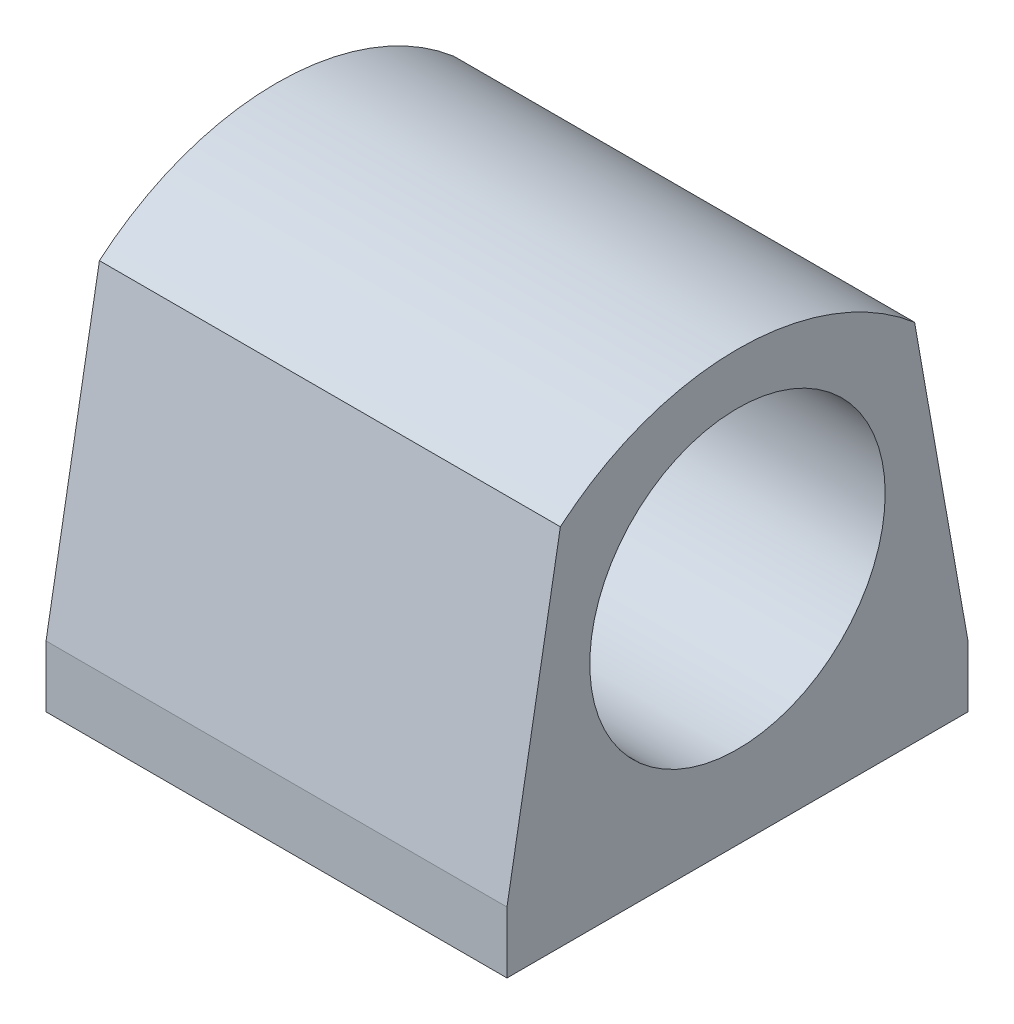
ISO-10303-21;
HEADER;
FILE_DESCRIPTION(('STEP AP214'),'2;1');
FILE_NAME('part.step','',(''),(''),'','','');
FILE_SCHEMA(('AUTOMOTIVE_DESIGN { 1 0 10303 214 1 1 1 1 }'));
ENDSEC;
DATA;
#1=APPLICATION_CONTEXT('core data for automotive mechanical design processes');
#2=APPLICATION_PROTOCOL_DEFINITION('international standard','automotive_design',2000,#1);
#3=PRODUCT_CONTEXT('',#1,'mechanical');
#4=PRODUCT('Part','Part','',(#3));
#5=PRODUCT_RELATED_PRODUCT_CATEGORY('part','',(#4));
#6=PRODUCT_DEFINITION_FORMATION('','',#4);
#7=PRODUCT_DEFINITION_CONTEXT('part definition',#1,'design');
#8=PRODUCT_DEFINITION('design','',#6,#7);
#9=PRODUCT_DEFINITION_SHAPE('','',#8);
#10=(LENGTH_UNIT() NAMED_UNIT(*) SI_UNIT(.MILLI.,.METRE.));
#11=(NAMED_UNIT(*) PLANE_ANGLE_UNIT() SI_UNIT($,.RADIAN.));
#12=(NAMED_UNIT(*) SI_UNIT($,.STERADIAN.) SOLID_ANGLE_UNIT());
#13=UNCERTAINTY_MEASURE_WITH_UNIT(LENGTH_MEASURE(1.E-05),#10,'distance_accuracy_value','');
#14=(GEOMETRIC_REPRESENTATION_CONTEXT(3) GLOBAL_UNCERTAINTY_ASSIGNED_CONTEXT((#13)) GLOBAL_UNIT_ASSIGNED_CONTEXT((#10,
#11,#12)) REPRESENTATION_CONTEXT('',''));
#15=CARTESIAN_POINT('',(0.,0.,0.));
#16=DIRECTION('',(0.,0.,1.));
#17=DIRECTION('',(1.,0.,0.));
#18=AXIS2_PLACEMENT_3D('',#15,#16,#17);
#19=CARTESIAN_POINT('',(0.,0.,0.));
#20=DIRECTION('',(0.,-1.,0.));
#21=DIRECTION('',(0.,0.,-1.));
#22=AXIS2_PLACEMENT_3D('',#19,#20,#21);
#23=PLANE('',#22);
#24=DIRECTION('',(0.,0.,1.));
#25=VECTOR('',#24,1.);
#26=CARTESIAN_POINT('',(-19.05,0.,19.05));
#27=LINE('',#26,#25);
#28=CARTESIAN_POINT('',(-19.05,0.,-13.97));
#29=VERTEX_POINT('',#28);
#30=CARTESIAN_POINT('',(-19.05,0.,19.05));
#31=VERTEX_POINT('',#30);
#32=EDGE_CURVE('E139',#29,#31,#27,.T.);
#33=ORIENTED_EDGE('',*,*,#32,.F.);
#34=DIRECTION('',(1.,0.,0.));
#35=VECTOR('',#34,1.);
#36=CARTESIAN_POINT('',(0.,0.,-13.97));
#37=LINE('',#36,#35);
#38=CARTESIAN_POINT('',(0.,0.,-13.97));
#39=VERTEX_POINT('',#38);
#40=EDGE_CURVE('E135',#29,#39,#37,.T.);
#41=ORIENTED_EDGE('',*,*,#40,.T.);
#42=DIRECTION('',(0.,0.,-1.));
#43=VECTOR('',#42,1.);
#44=CARTESIAN_POINT('',(0.,0.,-13.97));
#45=LINE('',#44,#43);
#46=CARTESIAN_POINT('',(0.,0.,-19.05));
#47=VERTEX_POINT('',#46);
#48=EDGE_CURVE('E122',#39,#47,#45,.T.);
#49=ORIENTED_EDGE('',*,*,#48,.T.);
#50=DIRECTION('',(-1.,0.,0.));
#51=VECTOR('',#50,1.);
#52=CARTESIAN_POINT('',(-19.05,0.,-19.05));
#53=LINE('',#52,#51);
#54=CARTESIAN_POINT('',(19.05,0.,-19.05));
#55=VERTEX_POINT('',#54);
#56=EDGE_CURVE('E181',#55,#47,#53,.T.);
#57=ORIENTED_EDGE('',*,*,#56,.F.);
#58=DIRECTION('',(0.,0.,-1.));
#59=VECTOR('',#58,1.);
#60=CARTESIAN_POINT('',(19.05,0.,19.05));
#61=LINE('',#60,#59);
#62=CARTESIAN_POINT('',(19.05,0.,19.05));
#63=VERTEX_POINT('',#62);
#64=EDGE_CURVE('E172',#63,#55,#61,.T.);
#65=ORIENTED_EDGE('',*,*,#64,.F.);
#66=DIRECTION('',(1.,0.,0.));
#67=VECTOR('',#66,1.);
#68=CARTESIAN_POINT('',(-19.05,0.,19.05));
#69=LINE('',#68,#67);
#70=EDGE_CURVE('E90',#31,#63,#69,.T.);
#71=ORIENTED_EDGE('',*,*,#70,.F.);
#72=EDGE_LOOP('',(#33,#41,#49,#57,#65,#71));
#73=FACE_BOUND('',#72,.T.);
#74=ADVANCED_FACE('F49',(#73),#23,.T.);
#75=CARTESIAN_POINT('',(19.05,5.08,19.05));
#76=DIRECTION('',(-1.,0.,0.));
#77=DIRECTION('',(0.,0.,1.));
#78=AXIS2_PLACEMENT_3D('',#75,#76,#77);
#79=PLANE('',#78);
#80=CARTESIAN_POINT('',(19.05,19.05,0.));
#81=DIRECTION('',(1.,0.,0.));
#82=DIRECTION('',(0.,0.,-1.));
#83=AXIS2_PLACEMENT_3D('',#80,#81,#82);
#84=CIRCLE('',#83,12.2084592);
#85=CARTESIAN_POINT('',(19.05,19.05,-12.2084592));
#86=VERTEX_POINT('',#85);
#87=EDGE_CURVE('E144',#86,#86,#84,.T.);
#88=ORIENTED_EDGE('',*,*,#87,.F.);
#89=EDGE_LOOP('',(#88));
#90=FACE_BOUND('',#89,.T.);
#91=ORIENTED_EDGE('',*,*,#64,.T.);
#92=DIRECTION('',(0.,-1.,0.));
#93=VECTOR('',#92,1.);
#94=CARTESIAN_POINT('',(19.05,5.08,-19.05));
#95=LINE('',#94,#93);
#96=CARTESIAN_POINT('',(19.05,5.08,-19.05));
#97=VERTEX_POINT('',#96);
#98=EDGE_CURVE('E13',#97,#55,#95,.T.);
#99=ORIENTED_EDGE('',*,*,#98,.F.);
#100=DIRECTION('',(0.,0.984807753012207,0.173648177666935));
#101=VECTOR('',#100,1.);
#102=CARTESIAN_POINT('',(19.05,5.08,-19.05));
#103=LINE('',#102,#101);
#104=CARTESIAN_POINT('',(19.05,30.0941169265101,-14.6393362872599));
#105=VERTEX_POINT('',#104);
#106=EDGE_CURVE('E149',#97,#105,#103,.T.);
#107=ORIENTED_EDGE('',*,*,#106,.T.);
#108=CARTESIAN_POINT('',(19.05,12.9099699901589,1.11022302462516E-13));
#109=DIRECTION('',(1.,0.,0.));
#110=DIRECTION('',(0.,0.,1.));
#111=AXIS2_PLACEMENT_3D('',#108,#109,#110);
#112=CIRCLE('',#111,22.5744340540708);
#113=CARTESIAN_POINT('',(19.05,30.0941169265101,14.6393362872601));
#114=VERTEX_POINT('',#113);
#115=EDGE_CURVE('E165',#105,#114,#112,.T.);
#116=ORIENTED_EDGE('',*,*,#115,.T.);
#117=DIRECTION('',(0.,-0.984807753012209,0.173648177666927));
#118=VECTOR('',#117,1.);
#119=CARTESIAN_POINT('',(19.05,5.08,19.05));
#120=LINE('',#119,#118);
#121=CARTESIAN_POINT('',(19.05,5.08,19.05));
#122=VERTEX_POINT('',#121);
#123=EDGE_CURVE('E156',#114,#122,#120,.T.);
#124=ORIENTED_EDGE('',*,*,#123,.T.);
#125=DIRECTION('',(0.,-1.,0.));
#126=VECTOR('',#125,1.);
#127=CARTESIAN_POINT('',(19.05,5.08,19.05));
#128=LINE('',#127,#126);
#129=EDGE_CURVE('E178',#122,#63,#128,.T.);
#130=ORIENTED_EDGE('',*,*,#129,.T.);
#131=EDGE_LOOP('',(#91,#99,#107,#116,#124,#130));
#132=FACE_BOUND('',#131,.T.);
#133=ADVANCED_FACE('F51',(#90,#132),#79,.F.);
#134=CARTESIAN_POINT('',(-19.05,5.08,-19.05));
#135=DIRECTION('',(0.,0.,1.));
#136=DIRECTION('',(1.,0.,0.));
#137=AXIS2_PLACEMENT_3D('',#134,#135,#136);
#138=PLANE('',#137);
#139=ORIENTED_EDGE('',*,*,#56,.T.);
#140=DIRECTION('',(-0.707106781186548,-0.707106781186547,0.));
#141=VECTOR('',#140,1.);
#142=CARTESIAN_POINT('',(-19.05,-19.05,-19.05));
#143=LINE('',#142,#141);
#144=CARTESIAN_POINT('',(-19.05,-19.05,-19.05));
#145=VERTEX_POINT('',#144);
#146=EDGE_CURVE('E64',#47,#145,#143,.T.);
#147=ORIENTED_EDGE('',*,*,#146,.T.);
#148=DIRECTION('',(0.,-1.,0.));
#149=VECTOR('',#148,1.);
#150=CARTESIAN_POINT('',(-19.05,5.08,-19.05));
#151=LINE('',#150,#149);
#152=CARTESIAN_POINT('',(-19.05,5.08,-19.05));
#153=VERTEX_POINT('',#152);
#154=EDGE_CURVE('E57',#153,#145,#151,.T.);
#155=ORIENTED_EDGE('',*,*,#154,.F.);
#156=DIRECTION('',(-1.,0.,0.));
#157=VECTOR('',#156,1.);
#158=CARTESIAN_POINT('',(-19.05,5.08,-19.05));
#159=LINE('',#158,#157);
#160=EDGE_CURVE('E95',#97,#153,#159,.T.);
#161=ORIENTED_EDGE('',*,*,#160,.F.);
#162=ORIENTED_EDGE('',*,*,#98,.T.);
#163=EDGE_LOOP('',(#139,#147,#155,#161,#162));
#164=FACE_BOUND('',#163,.T.);
#165=ADVANCED_FACE('F189',(#164),#138,.F.);
#166=CARTESIAN_POINT('',(-19.05,5.08,19.05));
#167=DIRECTION('',(1.,0.,0.));
#168=DIRECTION('',(0.,0.,-1.));
#169=AXIS2_PLACEMENT_3D('',#166,#167,#168);
#170=PLANE('',#169);
#171=CARTESIAN_POINT('',(-19.05,19.05,0.));
#172=DIRECTION('',(1.,0.,0.));
#173=DIRECTION('',(0.,0.,-1.));
#174=AXIS2_PLACEMENT_3D('',#171,#172,#173);
#175=CIRCLE('',#174,12.2084592);
#176=CARTESIAN_POINT('',(-19.05,19.05,-12.2084592));
#177=VERTEX_POINT('',#176);
#178=EDGE_CURVE('E146',#177,#177,#175,.T.);
#179=ORIENTED_EDGE('',*,*,#178,.T.);
#180=EDGE_LOOP('',(#179));
#181=FACE_BOUND('',#180,.T.);
#182=ORIENTED_EDGE('',*,*,#154,.T.);
#183=DIRECTION('',(0.,0.,-1.));
#184=VECTOR('',#183,1.);
#185=CARTESIAN_POINT('',(-19.05,-19.05,-13.97));
#186=LINE('',#185,#184);
#187=CARTESIAN_POINT('',(-19.05,-19.05,-13.97));
#188=VERTEX_POINT('',#187);
#189=EDGE_CURVE('E130',#188,#145,#186,.T.);
#190=ORIENTED_EDGE('',*,*,#189,.F.);
#191=DIRECTION('',(0.,1.,0.));
#192=VECTOR('',#191,1.);
#193=CARTESIAN_POINT('',(-19.05,0.,-13.97));
#194=LINE('',#193,#192);
#195=EDGE_CURVE('E131',#188,#29,#194,.T.);
#196=ORIENTED_EDGE('',*,*,#195,.T.);
#197=ORIENTED_EDGE('',*,*,#32,.T.);
#198=DIRECTION('',(0.,-1.,0.));
#199=VECTOR('',#198,1.);
#200=CARTESIAN_POINT('',(-19.05,5.08,19.05));
#201=LINE('',#200,#199);
#202=CARTESIAN_POINT('',(-19.05,5.08,19.05));
#203=VERTEX_POINT('',#202);
#204=EDGE_CURVE('E73',#203,#31,#201,.T.);
#205=ORIENTED_EDGE('',*,*,#204,.F.);
#206=DIRECTION('',(0.,-0.984807753012209,0.173648177666927));
#207=VECTOR('',#206,1.);
#208=CARTESIAN_POINT('',(-19.05,5.08,19.05));
#209=LINE('',#208,#207);
#210=CARTESIAN_POINT('',(-19.05,30.0941169265101,14.6393362872601));
#211=VERTEX_POINT('',#210);
#212=EDGE_CURVE('E159',#211,#203,#209,.T.);
#213=ORIENTED_EDGE('',*,*,#212,.F.);
#214=CARTESIAN_POINT('',(-19.05,12.9099699901589,1.11022302462516E-13));
#215=DIRECTION('',(1.,0.,0.));
#216=DIRECTION('',(0.,0.,1.));
#217=AXIS2_PLACEMENT_3D('',#214,#215,#216);
#218=CIRCLE('',#217,22.5744340540708);
#219=CARTESIAN_POINT('',(-19.05,30.0941169265101,-14.6393362872599));
#220=VERTEX_POINT('',#219);
#221=EDGE_CURVE('E155',#220,#211,#218,.T.);
#222=ORIENTED_EDGE('',*,*,#221,.F.);
#223=DIRECTION('',(0.,0.984807753012207,0.173648177666935));
#224=VECTOR('',#223,1.);
#225=CARTESIAN_POINT('',(-19.05,5.08,-19.05));
#226=LINE('',#225,#224);
#227=EDGE_CURVE('E152',#153,#220,#226,.T.);
#228=ORIENTED_EDGE('',*,*,#227,.F.);
#229=EDGE_LOOP('',(#182,#190,#196,#197,#205,#213,#222,#228));
#230=FACE_BOUND('',#229,.T.);
#231=ADVANCED_FACE('F187',(#181,#230),#170,.F.);
#232=CARTESIAN_POINT('',(-19.05,5.08,19.05));
#233=DIRECTION('',(0.,0.,-1.));
#234=DIRECTION('',(-1.,0.,0.));
#235=AXIS2_PLACEMENT_3D('',#232,#233,#234);
#236=PLANE('',#235);
#237=ORIENTED_EDGE('',*,*,#70,.T.);
#238=ORIENTED_EDGE('',*,*,#129,.F.);
#239=DIRECTION('',(1.,0.,0.));
#240=VECTOR('',#239,1.);
#241=CARTESIAN_POINT('',(-19.05,5.08,19.05));
#242=LINE('',#241,#240);
#243=EDGE_CURVE('E175',#203,#122,#242,.T.);
#244=ORIENTED_EDGE('',*,*,#243,.F.);
#245=ORIENTED_EDGE('',*,*,#204,.T.);
#246=EDGE_LOOP('',(#237,#238,#244,#245));
#247=FACE_BOUND('',#246,.T.);
#248=ADVANCED_FACE('F194',(#247),#236,.F.);
#249=CARTESIAN_POINT('',(-19.05,5.08,19.05));
#250=DIRECTION('',(0.,0.173648177666927,0.984807753012209));
#251=DIRECTION('',(0.,-0.984807753012209,0.173648177666927));
#252=AXIS2_PLACEMENT_3D('',#249,#250,#251);
#253=PLANE('',#252);
#254=ORIENTED_EDGE('',*,*,#123,.F.);
#255=DIRECTION('',(1.,0.,0.));
#256=VECTOR('',#255,1.);
#257=CARTESIAN_POINT('',(-19.05,30.0941169265101,14.6393362872601));
#258=LINE('',#257,#256);
#259=EDGE_CURVE('E170',#211,#114,#258,.T.);
#260=ORIENTED_EDGE('',*,*,#259,.F.);
#261=ORIENTED_EDGE('',*,*,#212,.T.);
#262=ORIENTED_EDGE('',*,*,#243,.T.);
#263=EDGE_LOOP('',(#254,#260,#261,#262));
#264=FACE_BOUND('',#263,.T.);
#265=ADVANCED_FACE('F196',(#264),#253,.T.);
#266=CARTESIAN_POINT('',(-19.05,12.9099699901589,1.11022302462516E-13));
#267=DIRECTION('',(1.,0.,0.));
#268=DIRECTION('',(0.,0.,-1.));
#269=AXIS2_PLACEMENT_3D('',#266,#267,#268);
#270=CYLINDRICAL_SURFACE('',#269,22.5744340540708);
#271=ORIENTED_EDGE('',*,*,#115,.F.);
#272=DIRECTION('',(1.,0.,0.));
#273=VECTOR('',#272,1.);
#274=CARTESIAN_POINT('',(-19.05,30.0941169265101,-14.6393362872599));
#275=LINE('',#274,#273);
#276=EDGE_CURVE('E162',#220,#105,#275,.T.);
#277=ORIENTED_EDGE('',*,*,#276,.F.);
#278=ORIENTED_EDGE('',*,*,#221,.T.);
#279=ORIENTED_EDGE('',*,*,#259,.T.);
#280=EDGE_LOOP('',(#271,#277,#278,#279));
#281=FACE_BOUND('',#280,.T.);
#282=ADVANCED_FACE('F201',(#281),#270,.T.);
#283=CARTESIAN_POINT('',(-19.05,5.08,-19.05));
#284=DIRECTION('',(0.,0.173648177666935,-0.984807753012207));
#285=DIRECTION('',(0.,0.984807753012207,0.173648177666935));
#286=AXIS2_PLACEMENT_3D('',#283,#284,#285);
#287=PLANE('',#286);
#288=ORIENTED_EDGE('',*,*,#106,.F.);
#289=ORIENTED_EDGE('',*,*,#160,.T.);
#290=ORIENTED_EDGE('',*,*,#227,.T.);
#291=ORIENTED_EDGE('',*,*,#276,.T.);
#292=EDGE_LOOP('',(#288,#289,#290,#291));
#293=FACE_BOUND('',#292,.T.);
#294=ADVANCED_FACE('F199',(#293),#287,.T.);
#295=CARTESIAN_POINT('',(-19.05,19.05,0.));
#296=DIRECTION('',(1.,0.,0.));
#297=DIRECTION('',(0.,0.,-1.));
#298=AXIS2_PLACEMENT_3D('',#295,#296,#297);
#299=CYLINDRICAL_SURFACE('',#298,12.2084592);
#300=ORIENTED_EDGE('',*,*,#178,.F.);
#301=EDGE_LOOP('',(#300));
#302=FACE_BOUND('',#301,.T.);
#303=ORIENTED_EDGE('',*,*,#87,.T.);
#304=EDGE_LOOP('',(#303));
#305=FACE_BOUND('',#304,.T.);
#306=ADVANCED_FACE('F208',(#302,#305),#299,.F.);
#307=CARTESIAN_POINT('',(-19.05,-19.05,-13.97));
#308=DIRECTION('',(0.707106781186547,-0.707106781186548,0.));
#309=DIRECTION('',(0.707106781186548,0.707106781186547,0.));
#310=AXIS2_PLACEMENT_3D('',#307,#308,#309);
#311=PLANE('',#310);
#312=ORIENTED_EDGE('',*,*,#146,.F.);
#313=ORIENTED_EDGE('',*,*,#48,.F.);
#314=DIRECTION('',(-0.707106781186548,-0.707106781186547,0.));
#315=VECTOR('',#314,1.);
#316=CARTESIAN_POINT('',(-19.05,-19.05,-13.97));
#317=LINE('',#316,#315);
#318=EDGE_CURVE('E125',#39,#188,#317,.T.);
#319=ORIENTED_EDGE('',*,*,#318,.T.);
#320=ORIENTED_EDGE('',*,*,#189,.T.);
#321=EDGE_LOOP('',(#312,#313,#319,#320));
#322=FACE_BOUND('',#321,.T.);
#323=ADVANCED_FACE('F124',(#322),#311,.T.);
#324=CARTESIAN_POINT('',(0.,0.,-13.97));
#325=DIRECTION('',(0.,0.,1.));
#326=DIRECTION('',(1.,0.,0.));
#327=AXIS2_PLACEMENT_3D('',#324,#325,#326);
#328=PLANE('',#327);
#329=ORIENTED_EDGE('',*,*,#40,.F.);
#330=ORIENTED_EDGE('',*,*,#195,.F.);
#331=ORIENTED_EDGE('',*,*,#318,.F.);
#332=EDGE_LOOP('',(#329,#330,#331));
#333=FACE_BOUND('',#332,.T.);
#334=ADVANCED_FACE('F134',(#333),#328,.T.);
#335=CLOSED_SHELL('',(#74,#133,#165,#231,#248,#265,#282,#294,#306,#323,#334));
#336=MANIFOLD_SOLID_BREP('B2',#335);
#337=ADVANCED_BREP_SHAPE_REPRESENTATION('',(#18,#336),#14);
#338=SHAPE_DEFINITION_REPRESENTATION(#9,#337);
ENDSEC;
END-ISO-10303-21;
